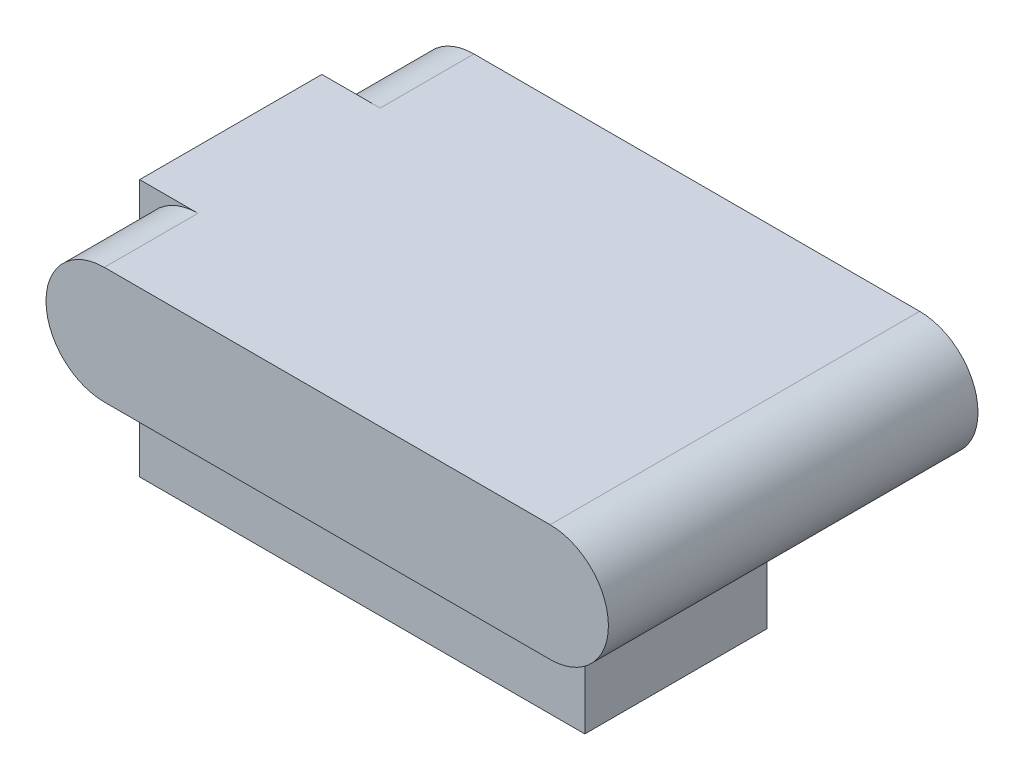
ISO-10303-21;
HEADER;
FILE_DESCRIPTION(('STEP AP214'),'2;1');
FILE_NAME('part.step','',(''),(''),'','','');
FILE_SCHEMA(('AUTOMOTIVE_DESIGN { 1 0 10303 214 1 1 1 1 }'));
ENDSEC;
DATA;
#1=APPLICATION_CONTEXT('core data for automotive mechanical design processes');
#2=APPLICATION_PROTOCOL_DEFINITION('international standard','automotive_design',2000,#1);
#3=PRODUCT_CONTEXT('',#1,'mechanical');
#4=PRODUCT('Part','Part','',(#3));
#5=PRODUCT_RELATED_PRODUCT_CATEGORY('part','',(#4));
#6=PRODUCT_DEFINITION_FORMATION('','',#4);
#7=PRODUCT_DEFINITION_CONTEXT('part definition',#1,'design');
#8=PRODUCT_DEFINITION('design','',#6,#7);
#9=PRODUCT_DEFINITION_SHAPE('','',#8);
#10=(LENGTH_UNIT() NAMED_UNIT(*) SI_UNIT(.MILLI.,.METRE.));
#11=(NAMED_UNIT(*) PLANE_ANGLE_UNIT() SI_UNIT($,.RADIAN.));
#12=(NAMED_UNIT(*) SI_UNIT($,.STERADIAN.) SOLID_ANGLE_UNIT());
#13=UNCERTAINTY_MEASURE_WITH_UNIT(LENGTH_MEASURE(1.E-05),#10,'distance_accuracy_value','');
#14=(GEOMETRIC_REPRESENTATION_CONTEXT(3) GLOBAL_UNCERTAINTY_ASSIGNED_CONTEXT((#13)) GLOBAL_UNIT_ASSIGNED_CONTEXT((#10,
#11,#12)) REPRESENTATION_CONTEXT('',''));
#15=CARTESIAN_POINT('',(0.,0.,0.));
#16=DIRECTION('',(0.,0.,1.));
#17=DIRECTION('',(1.,0.,0.));
#18=AXIS2_PLACEMENT_3D('',#15,#16,#17);
#19=CARTESIAN_POINT('',(0.,34.925,0.));
#20=DIRECTION('',(0.,0.,-1.));
#21=DIRECTION('',(-1.,0.,0.));
#22=AXIS2_PLACEMENT_3D('',#19,#20,#21);
#23=PLANE('',#22);
#24=DIRECTION('',(0.,-1.,0.));
#25=VECTOR('',#24,1.);
#26=CARTESIAN_POINT('',(0.,34.925,0.));
#27=LINE('',#26,#25);
#28=CARTESIAN_POINT('',(0.,34.925,0.));
#29=VERTEX_POINT('',#28);
#30=CARTESIAN_POINT('',(0.,27.0129,0.));
#31=VERTEX_POINT('',#30);
#32=EDGE_CURVE('E42',#29,#31,#27,.T.);
#33=ORIENTED_EDGE('',*,*,#32,.T.);
#34=CARTESIAN_POINT('',(7.9121,27.0129,0.));
#35=DIRECTION('',(0.,0.,-1.));
#36=DIRECTION('',(-1.,0.,0.));
#37=AXIS2_PLACEMENT_3D('',#34,#35,#36);
#38=CIRCLE('',#37,7.9121);
#39=CARTESIAN_POINT('',(7.9121,34.925,0.));
#40=VERTEX_POINT('',#39);
#41=EDGE_CURVE('E131',#31,#40,#38,.T.);
#42=ORIENTED_EDGE('',*,*,#41,.T.);
#43=DIRECTION('',(1.,0.,0.));
#44=VECTOR('',#43,1.);
#45=CARTESIAN_POINT('',(0.,34.925,0.));
#46=LINE('',#45,#44);
#47=EDGE_CURVE('E217',#29,#40,#46,.T.);
#48=ORIENTED_EDGE('',*,*,#47,.F.);
#49=EDGE_LOOP('',(#33,#42,#48));
#50=FACE_BOUND('',#49,.T.);
#51=ADVANCED_FACE('F34',(#50),#23,.F.);
#52=CARTESIAN_POINT('',(0.,34.925,-24.7142));
#53=DIRECTION('',(0.,0.,1.));
#54=DIRECTION('',(1.,0.,0.));
#55=AXIS2_PLACEMENT_3D('',#52,#53,#54);
#56=PLANE('',#55);
#57=DIRECTION('',(-1.,0.,0.));
#58=VECTOR('',#57,1.);
#59=CARTESIAN_POINT('',(0.,34.925,-24.7142));
#60=LINE('',#59,#58);
#61=CARTESIAN_POINT('',(7.9121,34.925,-24.7142));
#62=VERTEX_POINT('',#61);
#63=CARTESIAN_POINT('',(0.,34.925,-24.7142));
#64=VERTEX_POINT('',#63);
#65=EDGE_CURVE('E57',#62,#64,#60,.T.);
#66=ORIENTED_EDGE('',*,*,#65,.F.);
#67=CARTESIAN_POINT('',(7.9121,27.0129,-24.7142));
#68=DIRECTION('',(0.,0.,1.));
#69=DIRECTION('',(1.,0.,0.));
#70=AXIS2_PLACEMENT_3D('',#67,#68,#69);
#71=CIRCLE('',#70,7.9121);
#72=CARTESIAN_POINT('',(0.,27.0129,-24.7142));
#73=VERTEX_POINT('',#72);
#74=EDGE_CURVE('E214',#62,#73,#71,.T.);
#75=ORIENTED_EDGE('',*,*,#74,.T.);
#76=DIRECTION('',(0.,-1.,0.));
#77=VECTOR('',#76,1.);
#78=CARTESIAN_POINT('',(0.,34.925,-24.7142));
#79=LINE('',#78,#77);
#80=EDGE_CURVE('E85',#64,#73,#79,.T.);
#81=ORIENTED_EDGE('',*,*,#80,.F.);
#82=EDGE_LOOP('',(#66,#75,#81));
#83=FACE_BOUND('',#82,.T.);
#84=ADVANCED_FACE('F221',(#83),#56,.F.);
#85=CARTESIAN_POINT('',(0.,34.925,0.));
#86=DIRECTION('',(1.,0.,0.));
#87=DIRECTION('',(0.,0.,-1.));
#88=AXIS2_PLACEMENT_3D('',#85,#86,#87);
#89=PLANE('',#88);
#90=ORIENTED_EDGE('',*,*,#80,.T.);
#91=CARTESIAN_POINT('',(0.,0.,-24.7142));
#92=VERTEX_POINT('',#91);
#93=EDGE_CURVE('E78',#73,#92,#79,.T.);
#94=ORIENTED_EDGE('',*,*,#93,.T.);
#95=DIRECTION('',(0.,0.,1.));
#96=VECTOR('',#95,1.);
#97=CARTESIAN_POINT('',(0.,0.,0.));
#98=LINE('',#97,#96);
#99=CARTESIAN_POINT('',(0.,0.,0.));
#100=VERTEX_POINT('',#99);
#101=EDGE_CURVE('E82',#92,#100,#98,.T.);
#102=ORIENTED_EDGE('',*,*,#101,.T.);
#103=EDGE_CURVE('E115',#31,#100,#27,.T.);
#104=ORIENTED_EDGE('',*,*,#103,.F.);
#105=ORIENTED_EDGE('',*,*,#32,.F.);
#106=DIRECTION('',(0.,0.,1.));
#107=VECTOR('',#106,1.);
#108=CARTESIAN_POINT('',(0.,34.925,0.));
#109=LINE('',#108,#107);
#110=EDGE_CURVE('E97',#64,#29,#109,.T.);
#111=ORIENTED_EDGE('',*,*,#110,.F.);
#112=EDGE_LOOP('',(#90,#94,#102,#104,#105,#111));
#113=FACE_BOUND('',#112,.T.);
#114=ADVANCED_FACE('F36',(#113),#89,.F.);
#115=DIRECTION('',(-1.,0.,0.));
#116=VECTOR('',#115,1.);
#117=CARTESIAN_POINT('',(0.,19.1008,0.));
#118=LINE('',#117,#116);
#119=CARTESIAN_POINT('',(60.3758,19.1008,0.));
#120=VERTEX_POINT('',#119);
#121=CARTESIAN_POINT('',(7.9121,19.1008,0.));
#122=VERTEX_POINT('',#121);
#123=EDGE_CURVE('E104',#120,#122,#118,.T.);
#124=ORIENTED_EDGE('',*,*,#123,.T.);
#125=EDGE_CURVE('E126',#122,#31,#38,.T.);
#126=ORIENTED_EDGE('',*,*,#125,.T.);
#127=ORIENTED_EDGE('',*,*,#103,.T.);
#128=DIRECTION('',(1.,0.,0.));
#129=VECTOR('',#128,1.);
#130=CARTESIAN_POINT('',(0.,0.,0.));
#131=LINE('',#130,#129);
#132=CARTESIAN_POINT('',(60.3758,0.,0.));
#133=VERTEX_POINT('',#132);
#134=EDGE_CURVE('E103',#100,#133,#131,.T.);
#135=ORIENTED_EDGE('',*,*,#134,.T.);
#136=DIRECTION('',(0.,-1.,0.));
#137=VECTOR('',#136,1.);
#138=CARTESIAN_POINT('',(60.3758,34.925,0.));
#139=LINE('',#138,#137);
#140=EDGE_CURVE('E114',#120,#133,#139,.T.);
#141=ORIENTED_EDGE('',*,*,#140,.F.);
#142=EDGE_LOOP('',(#124,#126,#127,#135,#141));
#143=FACE_BOUND('',#142,.T.);
#144=ADVANCED_FACE('F123',(#143),#23,.F.);
#145=CARTESIAN_POINT('',(60.3758,34.925,0.));
#146=DIRECTION('',(-1.,0.,0.));
#147=DIRECTION('',(0.,0.,1.));
#148=AXIS2_PLACEMENT_3D('',#145,#146,#147);
#149=PLANE('',#148);
#150=DIRECTION('',(0.,-1.,0.));
#151=VECTOR('',#150,1.);
#152=CARTESIAN_POINT('',(60.3758,34.925,-24.7142));
#153=LINE('',#152,#151);
#154=CARTESIAN_POINT('',(60.3758,19.1008,-24.7142));
#155=VERTEX_POINT('',#154);
#156=CARTESIAN_POINT('',(60.3758,0.,-24.7142));
#157=VERTEX_POINT('',#156);
#158=EDGE_CURVE('E93',#155,#157,#153,.T.);
#159=ORIENTED_EDGE('',*,*,#158,.F.);
#160=DIRECTION('',(0.,0.,1.));
#161=VECTOR('',#160,1.);
#162=CARTESIAN_POINT('',(60.3758,19.1008,0.));
#163=LINE('',#162,#161);
#164=EDGE_CURVE('E49',#155,#120,#163,.T.);
#165=ORIENTED_EDGE('',*,*,#164,.T.);
#166=ORIENTED_EDGE('',*,*,#140,.T.);
#167=DIRECTION('',(0.,0.,-1.));
#168=VECTOR('',#167,1.);
#169=CARTESIAN_POINT('',(60.3758,0.,0.));
#170=LINE('',#169,#168);
#171=EDGE_CURVE('E98',#133,#157,#170,.T.);
#172=ORIENTED_EDGE('',*,*,#171,.T.);
#173=EDGE_LOOP('',(#159,#165,#166,#172));
#174=FACE_BOUND('',#173,.T.);
#175=ADVANCED_FACE('F229',(#174),#149,.F.);
#176=ORIENTED_EDGE('',*,*,#93,.F.);
#177=CARTESIAN_POINT('',(7.9121,19.1008,-24.7142));
#178=VERTEX_POINT('',#177);
#179=EDGE_CURVE('E207',#73,#178,#71,.T.);
#180=ORIENTED_EDGE('',*,*,#179,.T.);
#181=DIRECTION('',(1.,0.,0.));
#182=VECTOR('',#181,1.);
#183=CARTESIAN_POINT('',(0.,19.1008,-24.7142));
#184=LINE('',#183,#182);
#185=EDGE_CURVE('E11',#178,#155,#184,.T.);
#186=ORIENTED_EDGE('',*,*,#185,.T.);
#187=ORIENTED_EDGE('',*,*,#158,.T.);
#188=DIRECTION('',(-1.,0.,0.));
#189=VECTOR('',#188,1.);
#190=CARTESIAN_POINT('',(0.,0.,-24.7142));
#191=LINE('',#190,#189);
#192=EDGE_CURVE('E90',#157,#92,#191,.T.);
#193=ORIENTED_EDGE('',*,*,#192,.T.);
#194=EDGE_LOOP('',(#176,#180,#186,#187,#193));
#195=FACE_BOUND('',#194,.T.);
#196=ADVANCED_FACE('F91',(#195),#56,.F.);
#197=CARTESIAN_POINT('',(0.,34.925,0.));
#198=DIRECTION('',(0.,-1.,0.));
#199=DIRECTION('',(0.,0.,-1.));
#200=AXIS2_PLACEMENT_3D('',#197,#198,#199);
#201=PLANE('',#200);
#202=ORIENTED_EDGE('',*,*,#47,.T.);
#203=DIRECTION('',(0.,0.,1.));
#204=VECTOR('',#203,1.);
#205=CARTESIAN_POINT('',(7.9121,34.925,-37.4269));
#206=LINE('',#205,#204);
#207=CARTESIAN_POINT('',(7.9121,34.925,12.7));
#208=VERTEX_POINT('',#207);
#209=EDGE_CURVE('E208',#40,#208,#206,.T.);
#210=ORIENTED_EDGE('',*,*,#209,.T.);
#211=DIRECTION('',(-1.,0.,0.));
#212=VECTOR('',#211,1.);
#213=CARTESIAN_POINT('',(7.9121,34.925,12.7));
#214=LINE('',#213,#212);
#215=CARTESIAN_POINT('',(68.3641,34.925,12.7));
#216=VERTEX_POINT('',#215);
#217=EDGE_CURVE('E190',#216,#208,#214,.T.);
#218=ORIENTED_EDGE('',*,*,#217,.F.);
#219=DIRECTION('',(0.,0.,1.));
#220=VECTOR('',#219,1.);
#221=CARTESIAN_POINT('',(68.3641,34.925,-37.4269));
#222=LINE('',#221,#220);
#223=CARTESIAN_POINT('',(68.3641,34.925,-37.4269));
#224=VERTEX_POINT('',#223);
#225=EDGE_CURVE('E209',#224,#216,#222,.T.);
#226=ORIENTED_EDGE('',*,*,#225,.F.);
#227=DIRECTION('',(-1.,0.,0.));
#228=VECTOR('',#227,1.);
#229=CARTESIAN_POINT('',(7.9121,34.925,-37.4269));
#230=LINE('',#229,#228);
#231=CARTESIAN_POINT('',(7.9121,34.925,-37.4269));
#232=VERTEX_POINT('',#231);
#233=EDGE_CURVE('E175',#224,#232,#230,.T.);
#234=ORIENTED_EDGE('',*,*,#233,.T.);
#235=EDGE_CURVE('E205',#232,#62,#206,.T.);
#236=ORIENTED_EDGE('',*,*,#235,.T.);
#237=ORIENTED_EDGE('',*,*,#65,.T.);
#238=ORIENTED_EDGE('',*,*,#110,.T.);
#239=EDGE_LOOP('',(#202,#210,#218,#226,#234,#236,#237,#238));
#240=FACE_BOUND('',#239,.T.);
#241=ADVANCED_FACE('F219',(#240),#201,.F.);
#242=CARTESIAN_POINT('',(0.,0.,0.));
#243=DIRECTION('',(0.,-1.,0.));
#244=DIRECTION('',(0.,0.,-1.));
#245=AXIS2_PLACEMENT_3D('',#242,#243,#244);
#246=PLANE('',#245);
#247=ORIENTED_EDGE('',*,*,#101,.F.);
#248=ORIENTED_EDGE('',*,*,#192,.F.);
#249=ORIENTED_EDGE('',*,*,#171,.F.);
#250=ORIENTED_EDGE('',*,*,#134,.F.);
#251=EDGE_LOOP('',(#247,#248,#249,#250));
#252=FACE_BOUND('',#251,.T.);
#253=ADVANCED_FACE('F101',(#252),#246,.T.);
#254=CARTESIAN_POINT('',(7.9121,19.1008,-37.4269));
#255=DIRECTION('',(0.,-1.,0.));
#256=DIRECTION('',(0.,0.,-1.));
#257=AXIS2_PLACEMENT_3D('',#254,#255,#256);
#258=PLANE('',#257);
#259=ORIENTED_EDGE('',*,*,#123,.F.);
#260=ORIENTED_EDGE('',*,*,#164,.F.);
#261=ORIENTED_EDGE('',*,*,#185,.F.);
#262=DIRECTION('',(0.,0.,1.));
#263=VECTOR('',#262,1.);
#264=CARTESIAN_POINT('',(7.9121,19.1008,-37.4269));
#265=LINE('',#264,#263);
#266=CARTESIAN_POINT('',(7.9121,19.1008,-37.4269));
#267=VERTEX_POINT('',#266);
#268=EDGE_CURVE('E174',#267,#178,#265,.T.);
#269=ORIENTED_EDGE('',*,*,#268,.F.);
#270=DIRECTION('',(1.,0.,0.));
#271=VECTOR('',#270,1.);
#272=CARTESIAN_POINT('',(7.9121,19.1008,-37.4269));
#273=LINE('',#272,#271);
#274=CARTESIAN_POINT('',(68.3641,19.1008,-37.4269));
#275=VERTEX_POINT('',#274);
#276=EDGE_CURVE('E198',#267,#275,#273,.T.);
#277=ORIENTED_EDGE('',*,*,#276,.T.);
#278=DIRECTION('',(0.,0.,1.));
#279=VECTOR('',#278,1.);
#280=CARTESIAN_POINT('',(68.3641,19.1008,-37.4269));
#281=LINE('',#280,#279);
#282=CARTESIAN_POINT('',(68.3641,19.1008,12.7));
#283=VERTEX_POINT('',#282);
#284=EDGE_CURVE('E181',#275,#283,#281,.T.);
#285=ORIENTED_EDGE('',*,*,#284,.T.);
#286=DIRECTION('',(1.,0.,0.));
#287=VECTOR('',#286,1.);
#288=CARTESIAN_POINT('',(7.9121,19.1008,12.7));
#289=LINE('',#288,#287);
#290=CARTESIAN_POINT('',(7.9121,19.1008,12.7));
#291=VERTEX_POINT('',#290);
#292=EDGE_CURVE('E178',#291,#283,#289,.T.);
#293=ORIENTED_EDGE('',*,*,#292,.F.);
#294=EDGE_CURVE('E169',#122,#291,#265,.T.);
#295=ORIENTED_EDGE('',*,*,#294,.F.);
#296=EDGE_LOOP('',(#259,#260,#261,#269,#277,#285,#293,#295));
#297=FACE_BOUND('',#296,.T.);
#298=ADVANCED_FACE('F179',(#297),#258,.T.);
#299=CARTESIAN_POINT('',(7.9121,27.0129,-37.4269));
#300=DIRECTION('',(0.,0.,1.));
#301=DIRECTION('',(1.,0.,0.));
#302=AXIS2_PLACEMENT_3D('',#299,#300,#301);
#303=CYLINDRICAL_SURFACE('',#302,7.9121);
#304=ORIENTED_EDGE('',*,*,#41,.F.);
#305=ORIENTED_EDGE('',*,*,#125,.F.);
#306=ORIENTED_EDGE('',*,*,#294,.T.);
#307=CARTESIAN_POINT('',(7.9121,27.0129,12.7));
#308=DIRECTION('',(0.,0.,1.));
#309=DIRECTION('',(1.,0.,0.));
#310=AXIS2_PLACEMENT_3D('',#307,#308,#309);
#311=CIRCLE('',#310,7.9121);
#312=EDGE_CURVE('E173',#208,#291,#311,.T.);
#313=ORIENTED_EDGE('',*,*,#312,.F.);
#314=ORIENTED_EDGE('',*,*,#209,.F.);
#315=EDGE_LOOP('',(#304,#305,#306,#313,#314));
#316=FACE_BOUND('',#315,.T.);
#317=ADVANCED_FACE('F171',(#316),#303,.T.);
#318=ORIENTED_EDGE('',*,*,#74,.F.);
#319=ORIENTED_EDGE('',*,*,#235,.F.);
#320=CARTESIAN_POINT('',(7.9121,27.0129,-37.4269));
#321=DIRECTION('',(0.,0.,1.));
#322=DIRECTION('',(1.,0.,0.));
#323=AXIS2_PLACEMENT_3D('',#320,#321,#322);
#324=CIRCLE('',#323,7.9121);
#325=EDGE_CURVE('E195',#232,#267,#324,.T.);
#326=ORIENTED_EDGE('',*,*,#325,.T.);
#327=ORIENTED_EDGE('',*,*,#268,.T.);
#328=ORIENTED_EDGE('',*,*,#179,.F.);
#329=EDGE_LOOP('',(#318,#319,#326,#327,#328));
#330=FACE_BOUND('',#329,.T.);
#331=ADVANCED_FACE('F273',(#330),#303,.T.);
#332=CARTESIAN_POINT('',(68.3641,27.0129,-37.4269));
#333=DIRECTION('',(0.,0.,1.));
#334=DIRECTION('',(1.,0.,0.));
#335=AXIS2_PLACEMENT_3D('',#332,#333,#334);
#336=CYLINDRICAL_SURFACE('',#335,7.9121);
#337=ORIENTED_EDGE('',*,*,#225,.T.);
#338=CARTESIAN_POINT('',(68.3641,27.0129,12.7));
#339=DIRECTION('',(0.,0.,1.));
#340=DIRECTION('',(1.,0.,0.));
#341=AXIS2_PLACEMENT_3D('',#338,#339,#340);
#342=CIRCLE('',#341,7.9121);
#343=EDGE_CURVE('E185',#283,#216,#342,.T.);
#344=ORIENTED_EDGE('',*,*,#343,.F.);
#345=ORIENTED_EDGE('',*,*,#284,.F.);
#346=CARTESIAN_POINT('',(68.3641,27.0129,-37.4269));
#347=DIRECTION('',(0.,0.,1.));
#348=DIRECTION('',(1.,0.,0.));
#349=AXIS2_PLACEMENT_3D('',#346,#347,#348);
#350=CIRCLE('',#349,7.9121);
#351=EDGE_CURVE('E200',#275,#224,#350,.T.);
#352=ORIENTED_EDGE('',*,*,#351,.T.);
#353=EDGE_LOOP('',(#337,#344,#345,#352));
#354=FACE_BOUND('',#353,.T.);
#355=ADVANCED_FACE('F280',(#354),#336,.T.);
#356=CARTESIAN_POINT('',(7.9121,27.0129,-37.4269));
#357=DIRECTION('',(0.,0.,1.));
#358=DIRECTION('',(1.,0.,0.));
#359=AXIS2_PLACEMENT_3D('',#356,#357,#358);
#360=PLANE('',#359);
#361=ORIENTED_EDGE('',*,*,#325,.F.);
#362=ORIENTED_EDGE('',*,*,#233,.F.);
#363=ORIENTED_EDGE('',*,*,#351,.F.);
#364=ORIENTED_EDGE('',*,*,#276,.F.);
#365=EDGE_LOOP('',(#361,#362,#363,#364));
#366=FACE_BOUND('',#365,.T.);
#367=ADVANCED_FACE('F287',(#366),#360,.F.);
#368=CARTESIAN_POINT('',(7.9121,27.0129,12.7));
#369=DIRECTION('',(0.,0.,1.));
#370=DIRECTION('',(1.,0.,0.));
#371=AXIS2_PLACEMENT_3D('',#368,#369,#370);
#372=PLANE('',#371);
#373=ORIENTED_EDGE('',*,*,#312,.T.);
#374=ORIENTED_EDGE('',*,*,#292,.T.);
#375=ORIENTED_EDGE('',*,*,#343,.T.);
#376=ORIENTED_EDGE('',*,*,#217,.T.);
#377=EDGE_LOOP('',(#373,#374,#375,#376));
#378=FACE_BOUND('',#377,.T.);
#379=ADVANCED_FACE('F188',(#378),#372,.T.);
#380=CLOSED_SHELL('',(#51,#84,#114,#144,#175,#196,#241,#253,#298,#317,#331,#355,#367,#379));
#381=MANIFOLD_SOLID_BREP('B2',#380);
#382=ADVANCED_BREP_SHAPE_REPRESENTATION('',(#18,#381),#14);
#383=SHAPE_DEFINITION_REPRESENTATION(#9,#382);
ENDSEC;
END-ISO-10303-21;
